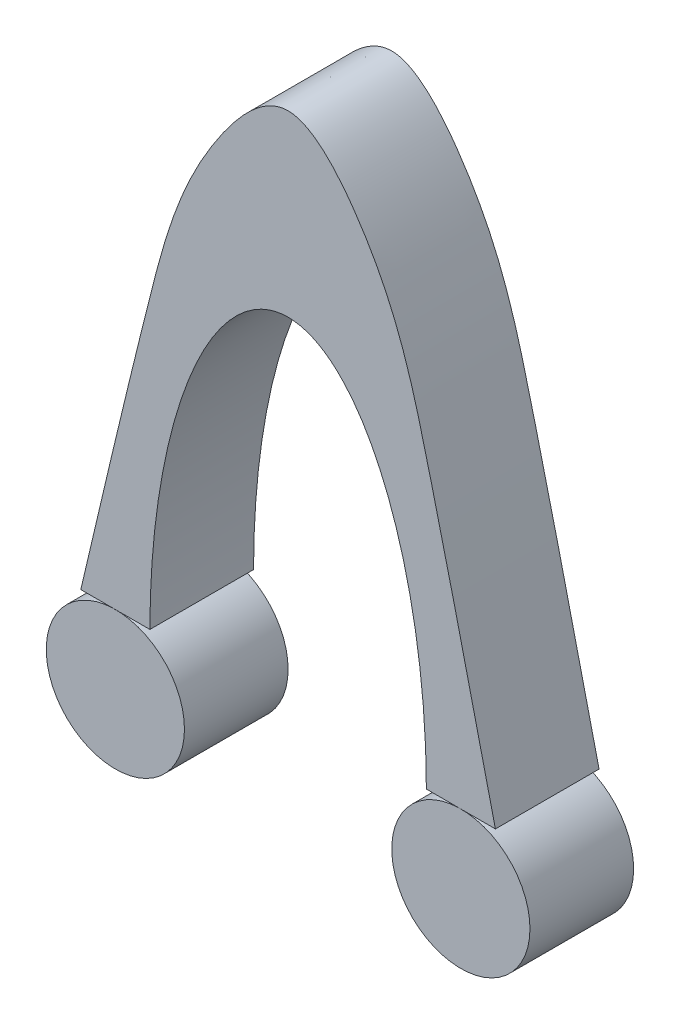
ISO-10303-21;
HEADER;
FILE_DESCRIPTION(('STEP AP214'),'2;1');
FILE_NAME('part.step','',(''),(''),'','','');
FILE_SCHEMA(('AUTOMOTIVE_DESIGN { 1 0 10303 214 1 1 1 1 }'));
ENDSEC;
DATA;
#1=APPLICATION_CONTEXT('core data for automotive mechanical design processes');
#2=APPLICATION_PROTOCOL_DEFINITION('international standard','automotive_design',2000,#1);
#3=PRODUCT_CONTEXT('',#1,'mechanical');
#4=PRODUCT('Part','Part','',(#3));
#5=PRODUCT_RELATED_PRODUCT_CATEGORY('part','',(#4));
#6=PRODUCT_DEFINITION_FORMATION('','',#4);
#7=PRODUCT_DEFINITION_CONTEXT('part definition',#1,'design');
#8=PRODUCT_DEFINITION('design','',#6,#7);
#9=PRODUCT_DEFINITION_SHAPE('','',#8);
#10=(LENGTH_UNIT() NAMED_UNIT(*) SI_UNIT(.MILLI.,.METRE.));
#11=(NAMED_UNIT(*) PLANE_ANGLE_UNIT() SI_UNIT($,.RADIAN.));
#12=(NAMED_UNIT(*) SI_UNIT($,.STERADIAN.) SOLID_ANGLE_UNIT());
#13=UNCERTAINTY_MEASURE_WITH_UNIT(LENGTH_MEASURE(1.E-05),#10,'distance_accuracy_value','');
#14=(GEOMETRIC_REPRESENTATION_CONTEXT(3) GLOBAL_UNCERTAINTY_ASSIGNED_CONTEXT((#13)) GLOBAL_UNIT_ASSIGNED_CONTEXT((#10,
#11,#12)) REPRESENTATION_CONTEXT('',''));
#15=CARTESIAN_POINT('',(0.,0.,0.));
#16=DIRECTION('',(0.,0.,1.));
#17=DIRECTION('',(1.,0.,0.));
#18=AXIS2_PLACEMENT_3D('',#15,#16,#17);
#19=CARTESIAN_POINT('',(-50.,-20.,15.));
#20=DIRECTION('',(0.,0.,-1.));
#21=DIRECTION('',(-1.,0.,0.));
#22=AXIS2_PLACEMENT_3D('',#19,#20,#21);
#23=CYLINDRICAL_SURFACE('',#22,20.);
#24=CARTESIAN_POINT('',(-50.,-20.,15.));
#25=DIRECTION('',(0.,0.,1.));
#26=DIRECTION('',(1.,0.,0.));
#27=AXIS2_PLACEMENT_3D('',#24,#25,#26);
#28=CIRCLE('',#27,20.);
#29=CARTESIAN_POINT('',(-30.,-20.,15.));
#30=VERTEX_POINT('',#29);
#31=EDGE_CURVE('E11',#30,#30,#28,.T.);
#32=ORIENTED_EDGE('',*,*,#31,.F.);
#33=EDGE_LOOP('',(#32));
#34=FACE_BOUND('',#33,.T.);
#35=CARTESIAN_POINT('',(-50.,-20.,-15.));
#36=DIRECTION('',(0.,0.,1.));
#37=DIRECTION('',(1.,0.,0.));
#38=AXIS2_PLACEMENT_3D('',#35,#36,#37);
#39=CIRCLE('',#38,20.);
#40=CARTESIAN_POINT('',(-30.,-20.,-15.));
#41=VERTEX_POINT('',#40);
#42=EDGE_CURVE('E43',#41,#41,#39,.T.);
#43=ORIENTED_EDGE('',*,*,#42,.T.);
#44=EDGE_LOOP('',(#43));
#45=FACE_BOUND('',#44,.T.);
#46=ADVANCED_FACE('F37',(#34,#45),#23,.T.);
#47=CARTESIAN_POINT('',(-50.,-20.,15.));
#48=DIRECTION('',(0.,0.,1.));
#49=DIRECTION('',(1.,0.,0.));
#50=AXIS2_PLACEMENT_3D('',#47,#48,#49);
#51=PLANE('',#50);
#52=ORIENTED_EDGE('',*,*,#31,.T.);
#53=EDGE_LOOP('',(#52));
#54=FACE_BOUND('',#53,.T.);
#55=ADVANCED_FACE('F52',(#54),#51,.T.);
#56=CARTESIAN_POINT('',(-50.,-20.,-15.));
#57=DIRECTION('',(0.,0.,1.));
#58=DIRECTION('',(1.,0.,0.));
#59=AXIS2_PLACEMENT_3D('',#56,#57,#58);
#60=PLANE('',#59);
#61=ORIENTED_EDGE('',*,*,#42,.F.);
#62=EDGE_LOOP('',(#61));
#63=FACE_BOUND('',#62,.T.);
#64=ADVANCED_FACE('F50',(#63),#60,.F.);
#65=CLOSED_SHELL('',(#46,#55,#64));
#66=MANIFOLD_SOLID_BREP('B2',#65);
#67=CARTESIAN_POINT('',(50.,-20.,15.));
#68=DIRECTION('',(0.,0.,-1.));
#69=DIRECTION('',(-1.,0.,0.));
#70=AXIS2_PLACEMENT_3D('',#67,#68,#69);
#71=CYLINDRICAL_SURFACE('',#70,20.);
#72=CARTESIAN_POINT('',(50.,-20.,15.));
#73=DIRECTION('',(0.,0.,1.));
#74=DIRECTION('',(1.,0.,0.));
#75=AXIS2_PLACEMENT_3D('',#72,#73,#74);
#76=CIRCLE('',#75,20.);
#77=CARTESIAN_POINT('',(70.,-20.,15.));
#78=VERTEX_POINT('',#77);
#79=EDGE_CURVE('E36',#78,#78,#76,.T.);
#80=ORIENTED_EDGE('',*,*,#79,.F.);
#81=EDGE_LOOP('',(#80));
#82=FACE_BOUND('',#81,.T.);
#83=CARTESIAN_POINT('',(50.,-20.,-15.));
#84=DIRECTION('',(0.,0.,1.));
#85=DIRECTION('',(1.,0.,0.));
#86=AXIS2_PLACEMENT_3D('',#83,#84,#85);
#87=CIRCLE('',#86,20.);
#88=CARTESIAN_POINT('',(70.,-20.,-15.));
#89=VERTEX_POINT('',#88);
#90=EDGE_CURVE('E92',#89,#89,#87,.T.);
#91=ORIENTED_EDGE('',*,*,#90,.T.);
#92=EDGE_LOOP('',(#91));
#93=FACE_BOUND('',#92,.T.);
#94=ADVANCED_FACE('F86',(#82,#93),#71,.T.);
#95=CARTESIAN_POINT('',(50.,-20.,15.));
#96=DIRECTION('',(0.,0.,1.));
#97=DIRECTION('',(1.,0.,0.));
#98=AXIS2_PLACEMENT_3D('',#95,#96,#97);
#99=PLANE('',#98);
#100=ORIENTED_EDGE('',*,*,#79,.T.);
#101=EDGE_LOOP('',(#100));
#102=FACE_BOUND('',#101,.T.);
#103=ADVANCED_FACE('F101',(#102),#99,.T.);
#104=CARTESIAN_POINT('',(50.,-20.,-15.));
#105=DIRECTION('',(0.,0.,1.));
#106=DIRECTION('',(1.,0.,0.));
#107=AXIS2_PLACEMENT_3D('',#104,#105,#106);
#108=PLANE('',#107);
#109=ORIENTED_EDGE('',*,*,#90,.F.);
#110=EDGE_LOOP('',(#109));
#111=FACE_BOUND('',#110,.T.);
#112=ADVANCED_FACE('F99',(#111),#108,.F.);
#113=CLOSED_SHELL('',(#94,#103,#112));
#114=MANIFOLD_SOLID_BREP('B6',#113);
#115=CARTESIAN_POINT('',(0.,0.,15.));
#116=DIRECTION('',(0.,0.,-1.));
#117=DIRECTION('',(0.,1.,0.));
#118=AXIS2_PLACEMENT_3D('',#115,#116,#117);
#119=ELLIPSE('',#118,98.2707629823991,40.);
#120=DIRECTION('',(0.,0.,-1.));
#121=VECTOR('',#120,1.);
#122=SURFACE_OF_LINEAR_EXTRUSION('',#119,#121);
#123=CARTESIAN_POINT('',(0.,0.,-15.));
#124=DIRECTION('',(0.,0.,-1.));
#125=DIRECTION('',(0.,1.,0.));
#126=AXIS2_PLACEMENT_3D('',#123,#124,#125);
#127=ELLIPSE('',#126,98.2707629823991,40.);
#128=CARTESIAN_POINT('',(-40.,0.,-15.));
#129=VERTEX_POINT('',#128);
#130=CARTESIAN_POINT('',(40.,0.,-15.));
#131=VERTEX_POINT('',#130);
#132=EDGE_CURVE('E171',#129,#131,#127,.T.);
#133=ORIENTED_EDGE('',*,*,#132,.T.);
#134=DIRECTION('',(0.,0.,-1.));
#135=VECTOR('',#134,1.);
#136=CARTESIAN_POINT('',(40.,0.,15.));
#137=LINE('',#136,#135);
#138=CARTESIAN_POINT('',(40.,0.,15.));
#139=VERTEX_POINT('',#138);
#140=EDGE_CURVE('E84',#139,#131,#137,.T.);
#141=ORIENTED_EDGE('',*,*,#140,.F.);
#142=CARTESIAN_POINT('',(-40.,0.,15.));
#143=VERTEX_POINT('',#142);
#144=EDGE_CURVE('E193',#143,#139,#119,.T.);
#145=ORIENTED_EDGE('',*,*,#144,.F.);
#146=DIRECTION('',(0.,0.,-1.));
#147=VECTOR('',#146,1.);
#148=CARTESIAN_POINT('',(-40.,0.,15.));
#149=LINE('',#148,#147);
#150=EDGE_CURVE('E183',#143,#129,#149,.T.);
#151=ORIENTED_EDGE('',*,*,#150,.T.);
#152=EDGE_LOOP('',(#133,#141,#145,#151));
#153=FACE_BOUND('',#152,.T.);
#154=ADVANCED_FACE('F126',(#153),#122,.F.);
#155=CARTESIAN_POINT('',(40.,0.,15.));
#156=DIRECTION('',(0.,1.,0.));
#157=DIRECTION('',(0.,0.,1.));
#158=AXIS2_PLACEMENT_3D('',#155,#156,#157);
#159=PLANE('',#158);
#160=DIRECTION('',(1.,0.,0.));
#161=VECTOR('',#160,1.);
#162=CARTESIAN_POINT('',(40.,0.,-15.));
#163=LINE('',#162,#161);
#164=CARTESIAN_POINT('',(60.,0.,-15.));
#165=VERTEX_POINT('',#164);
#166=EDGE_CURVE('E167',#131,#165,#163,.T.);
#167=ORIENTED_EDGE('',*,*,#166,.T.);
#168=DIRECTION('',(0.,0.,-1.));
#169=VECTOR('',#168,1.);
#170=CARTESIAN_POINT('',(60.,0.,15.));
#171=LINE('',#170,#169);
#172=CARTESIAN_POINT('',(60.,0.,15.));
#173=VERTEX_POINT('',#172);
#174=EDGE_CURVE('E134',#173,#165,#171,.T.);
#175=ORIENTED_EDGE('',*,*,#174,.F.);
#176=DIRECTION('',(1.,0.,0.));
#177=VECTOR('',#176,1.);
#178=CARTESIAN_POINT('',(40.,0.,15.));
#179=LINE('',#178,#177);
#180=EDGE_CURVE('E179',#139,#173,#179,.T.);
#181=ORIENTED_EDGE('',*,*,#180,.F.);
#182=ORIENTED_EDGE('',*,*,#140,.T.);
#183=EDGE_LOOP('',(#167,#175,#181,#182));
#184=FACE_BOUND('',#183,.T.);
#185=ADVANCED_FACE('F178',(#184),#159,.F.);
#186=CARTESIAN_POINT('',(60.,0.,15.));
#187=CARTESIAN_POINT('',(53.3733405124898,28.3024408279147,15.));
#188=CARTESIAN_POINT('',(42.5826478703767,74.3894535333717,15.));
#189=CARTESIAN_POINT('',(29.4012638043369,124.122067435405,15.));
#190=CARTESIAN_POINT('',(0.,158.433417030788,15.));
#191=CARTESIAN_POINT('',(-29.4012638043369,124.122067435405,15.));
#192=CARTESIAN_POINT('',(-42.5826478703768,74.3894535333717,15.));
#193=CARTESIAN_POINT('',(-53.3733405124898,28.3024408279147,15.));
#194=CARTESIAN_POINT('',(-60.,0.,15.));
#195=B_SPLINE_CURVE_WITH_KNOTS('',3,(#186,#187,#188,#189,#190,#191,#192,#193,#194),
.UNSPECIFIED.,.F.,.F.,(4,1,1,1,1,1,4),(0.,0.258777820032541,0.421387566967979,0.5,
0.578612433032021,0.74122217996746,1.),.UNSPECIFIED.);
#196=DIRECTION('',(0.,0.,-1.));
#197=VECTOR('',#196,1.);
#198=SURFACE_OF_LINEAR_EXTRUSION('',#195,#197);
#199=CARTESIAN_POINT('',(60.,0.,-15.));
#200=CARTESIAN_POINT('',(53.3733405124898,28.3024408279147,-15.));
#201=CARTESIAN_POINT('',(42.5826478703767,74.3894535333717,-15.));
#202=CARTESIAN_POINT('',(29.4012638043369,124.122067435405,-15.));
#203=CARTESIAN_POINT('',(0.,158.433417030788,-15.));
#204=CARTESIAN_POINT('',(-29.4012638043369,124.122067435405,-15.));
#205=CARTESIAN_POINT('',(-42.5826478703768,74.3894535333717,-15.));
#206=CARTESIAN_POINT('',(-53.3733405124898,28.3024408279147,-15.));
#207=CARTESIAN_POINT('',(-60.,0.,-15.));
#208=B_SPLINE_CURVE_WITH_KNOTS('',3,(#199,#200,#201,#202,#203,#204,#205,#206,#207),
.UNSPECIFIED.,.F.,.F.,(4,1,1,1,1,1,4),(0.,0.258777820032541,0.421387566967979,0.5,
0.578612433032021,0.74122217996746,1.),.UNSPECIFIED.);
#209=CARTESIAN_POINT('',(-60.,0.,-15.));
#210=VERTEX_POINT('',#209);
#211=EDGE_CURVE('E172',#165,#210,#208,.T.);
#212=ORIENTED_EDGE('',*,*,#211,.T.);
#213=DIRECTION('',(0.,0.,-1.));
#214=VECTOR('',#213,1.);
#215=CARTESIAN_POINT('',(-60.,0.,15.));
#216=LINE('',#215,#214);
#217=CARTESIAN_POINT('',(-60.,0.,15.));
#218=VERTEX_POINT('',#217);
#219=EDGE_CURVE('E256',#218,#210,#216,.T.);
#220=ORIENTED_EDGE('',*,*,#219,.F.);
#221=EDGE_CURVE('E146',#173,#218,#195,.T.);
#222=ORIENTED_EDGE('',*,*,#221,.F.);
#223=ORIENTED_EDGE('',*,*,#174,.T.);
#224=EDGE_LOOP('',(#212,#220,#222,#223));
#225=FACE_BOUND('',#224,.T.);
#226=ADVANCED_FACE('F206',(#225),#198,.F.);
#227=CARTESIAN_POINT('',(-60.,0.,15.));
#228=DIRECTION('',(0.,1.,0.));
#229=DIRECTION('',(0.,0.,1.));
#230=AXIS2_PLACEMENT_3D('',#227,#228,#229);
#231=PLANE('',#230);
#232=DIRECTION('',(1.,0.,0.));
#233=VECTOR('',#232,1.);
#234=CARTESIAN_POINT('',(-60.,0.,-15.));
#235=LINE('',#234,#233);
#236=EDGE_CURVE('E189',#210,#129,#235,.T.);
#237=ORIENTED_EDGE('',*,*,#236,.T.);
#238=ORIENTED_EDGE('',*,*,#150,.F.);
#239=DIRECTION('',(1.,0.,0.));
#240=VECTOR('',#239,1.);
#241=CARTESIAN_POINT('',(-60.,0.,15.));
#242=LINE('',#241,#240);
#243=EDGE_CURVE('E141',#218,#143,#242,.T.);
#244=ORIENTED_EDGE('',*,*,#243,.F.);
#245=ORIENTED_EDGE('',*,*,#219,.T.);
#246=EDGE_LOOP('',(#237,#238,#244,#245));
#247=FACE_BOUND('',#246,.T.);
#248=ADVANCED_FACE('F209',(#247),#231,.F.);
#249=CARTESIAN_POINT('',(0.,0.,15.));
#250=DIRECTION('',(0.,0.,1.));
#251=DIRECTION('',(1.,0.,0.));
#252=AXIS2_PLACEMENT_3D('',#249,#250,#251);
#253=PLANE('',#252);
#254=ORIENTED_EDGE('',*,*,#144,.T.);
#255=ORIENTED_EDGE('',*,*,#180,.T.);
#256=ORIENTED_EDGE('',*,*,#221,.T.);
#257=ORIENTED_EDGE('',*,*,#243,.T.);
#258=EDGE_LOOP('',(#254,#255,#256,#257));
#259=FACE_BOUND('',#258,.T.);
#260=ADVANCED_FACE('F237',(#259),#253,.T.);
#261=CARTESIAN_POINT('',(0.,0.,-15.));
#262=DIRECTION('',(0.,0.,1.));
#263=DIRECTION('',(1.,0.,0.));
#264=AXIS2_PLACEMENT_3D('',#261,#262,#263);
#265=PLANE('',#264);
#266=ORIENTED_EDGE('',*,*,#132,.F.);
#267=ORIENTED_EDGE('',*,*,#236,.F.);
#268=ORIENTED_EDGE('',*,*,#211,.F.);
#269=ORIENTED_EDGE('',*,*,#166,.F.);
#270=EDGE_LOOP('',(#266,#267,#268,#269));
#271=FACE_BOUND('',#270,.T.);
#272=ADVANCED_FACE('F168',(#271),#265,.F.);
#273=CLOSED_SHELL('',(#154,#185,#226,#248,#260,#272));
#274=MANIFOLD_SOLID_BREP('B31',#273);
#275=ADVANCED_BREP_SHAPE_REPRESENTATION('',(#18,#66,#114,#274),#14);
#276=SHAPE_DEFINITION_REPRESENTATION(#9,#275);
ENDSEC;
END-ISO-10303-21;
